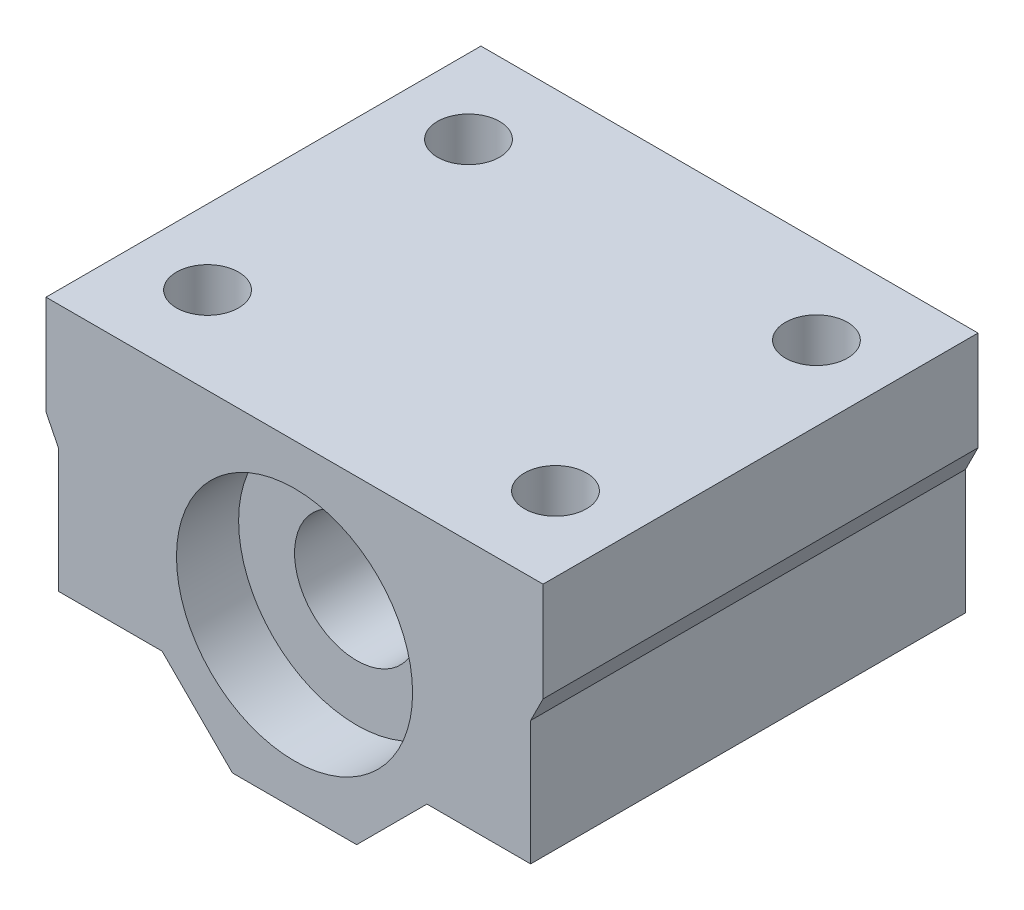
ISO-10303-21;
HEADER;
FILE_DESCRIPTION(('STEP AP214'),'2;1');
FILE_NAME('part.step','',(''),(''),'','','');
FILE_SCHEMA(('AUTOMOTIVE_DESIGN { 1 0 10303 214 1 1 1 1 }'));
ENDSEC;
DATA;
#1=APPLICATION_CONTEXT('core data for automotive mechanical design processes');
#2=APPLICATION_PROTOCOL_DEFINITION('international standard','automotive_design',2000,#1);
#3=PRODUCT_CONTEXT('',#1,'mechanical');
#4=PRODUCT('Part','Part','',(#3));
#5=PRODUCT_RELATED_PRODUCT_CATEGORY('part','',(#4));
#6=PRODUCT_DEFINITION_FORMATION('','',#4);
#7=PRODUCT_DEFINITION_CONTEXT('part definition',#1,'design');
#8=PRODUCT_DEFINITION('design','',#6,#7);
#9=PRODUCT_DEFINITION_SHAPE('','',#8);
#10=(LENGTH_UNIT() NAMED_UNIT(*) SI_UNIT(.MILLI.,.METRE.));
#11=(NAMED_UNIT(*) PLANE_ANGLE_UNIT() SI_UNIT($,.RADIAN.));
#12=(NAMED_UNIT(*) SI_UNIT($,.STERADIAN.) SOLID_ANGLE_UNIT());
#13=UNCERTAINTY_MEASURE_WITH_UNIT(LENGTH_MEASURE(1.E-05),#10,'distance_accuracy_value','');
#14=(GEOMETRIC_REPRESENTATION_CONTEXT(3) GLOBAL_UNCERTAINTY_ASSIGNED_CONTEXT((#13)) GLOBAL_UNIT_ASSIGNED_CONTEXT((#10,
#11,#12)) REPRESENTATION_CONTEXT('',''));
#15=CARTESIAN_POINT('',(0.,0.,0.));
#16=DIRECTION('',(0.,0.,1.));
#17=DIRECTION('',(1.,0.,0.));
#18=AXIS2_PLACEMENT_3D('',#15,#16,#17);
#19=CARTESIAN_POINT('',(0.,0.,0.));
#20=DIRECTION('',(0.,0.,1.));
#21=DIRECTION('',(1.,0.,0.));
#22=AXIS2_PLACEMENT_3D('',#19,#20,#21);
#23=PLANE('',#22);
#24=DIRECTION('',(0.707106781186546,0.707106781186549,0.));
#25=VECTOR('',#24,1.);
#26=CARTESIAN_POINT('',(5.,0.,0.));
#27=LINE('',#26,#25);
#28=CARTESIAN_POINT('',(5.,0.,0.));
#29=VERTEX_POINT('',#28);
#30=CARTESIAN_POINT('',(10.6568542494924,5.65685424949239,0.));
#31=VERTEX_POINT('',#30);
#32=EDGE_CURVE('E166',#29,#31,#27,.T.);
#33=ORIENTED_EDGE('',*,*,#32,.F.);
#34=DIRECTION('',(1.,0.,0.));
#35=VECTOR('',#34,1.);
#36=CARTESIAN_POINT('',(-5.,0.,0.));
#37=LINE('',#36,#35);
#38=CARTESIAN_POINT('',(-5.,0.,0.));
#39=VERTEX_POINT('',#38);
#40=EDGE_CURVE('E105',#39,#29,#37,.T.);
#41=ORIENTED_EDGE('',*,*,#40,.F.);
#42=DIRECTION('',(0.707106781186546,-0.707106781186549,0.));
#43=VECTOR('',#42,1.);
#44=CARTESIAN_POINT('',(-5.,0.,0.));
#45=LINE('',#44,#43);
#46=CARTESIAN_POINT('',(-10.6568542494924,5.65685424949239,0.));
#47=VERTEX_POINT('',#46);
#48=EDGE_CURVE('E99',#47,#39,#45,.T.);
#49=ORIENTED_EDGE('',*,*,#48,.F.);
#50=DIRECTION('',(1.,0.,0.));
#51=VECTOR('',#50,1.);
#52=CARTESIAN_POINT('',(-10.6568542494924,5.65685424949239,0.));
#53=LINE('',#52,#51);
#54=CARTESIAN_POINT('',(-19.,5.65685424949239,0.));
#55=VERTEX_POINT('',#54);
#56=EDGE_CURVE('E153',#55,#47,#53,.T.);
#57=ORIENTED_EDGE('',*,*,#56,.F.);
#58=DIRECTION('',(0.,-1.,0.));
#59=VECTOR('',#58,1.);
#60=CARTESIAN_POINT('',(-19.,5.65685424949239,0.));
#61=LINE('',#60,#59);
#62=CARTESIAN_POINT('',(-19.,15.6568542494924,0.));
#63=VERTEX_POINT('',#62);
#64=EDGE_CURVE('E192',#63,#55,#61,.T.);
#65=ORIENTED_EDGE('',*,*,#64,.F.);
#66=DIRECTION('',(0.447213595499958,-0.894427190999916,0.));
#67=VECTOR('',#66,1.);
#68=CARTESIAN_POINT('',(-19.,15.6568542494924,0.));
#69=LINE('',#68,#67);
#70=CARTESIAN_POINT('',(-20.,17.6568542494924,0.));
#71=VERTEX_POINT('',#70);
#72=EDGE_CURVE('E189',#71,#63,#69,.T.);
#73=ORIENTED_EDGE('',*,*,#72,.F.);
#74=DIRECTION('',(0.,-1.,0.));
#75=VECTOR('',#74,1.);
#76=CARTESIAN_POINT('',(-20.,17.6568542494924,0.));
#77=LINE('',#76,#75);
#78=CARTESIAN_POINT('',(-20.,25.6568542494924,0.));
#79=VERTEX_POINT('',#78);
#80=EDGE_CURVE('E186',#79,#71,#77,.T.);
#81=ORIENTED_EDGE('',*,*,#80,.F.);
#82=DIRECTION('',(-1.,0.,0.));
#83=VECTOR('',#82,1.);
#84=CARTESIAN_POINT('',(20.,25.6568542494924,0.));
#85=LINE('',#84,#83);
#86=CARTESIAN_POINT('',(20.,25.6568542494924,0.));
#87=VERTEX_POINT('',#86);
#88=EDGE_CURVE('E183',#87,#79,#85,.T.);
#89=ORIENTED_EDGE('',*,*,#88,.F.);
#90=DIRECTION('',(0.,1.,0.));
#91=VECTOR('',#90,1.);
#92=CARTESIAN_POINT('',(20.,17.6568542494924,0.));
#93=LINE('',#92,#91);
#94=CARTESIAN_POINT('',(20.,17.6568542494924,0.));
#95=VERTEX_POINT('',#94);
#96=EDGE_CURVE('E180',#95,#87,#93,.T.);
#97=ORIENTED_EDGE('',*,*,#96,.F.);
#98=DIRECTION('',(0.447213595499958,0.894427190999916,0.));
#99=VECTOR('',#98,1.);
#100=CARTESIAN_POINT('',(19.,15.6568542494924,0.));
#101=LINE('',#100,#99);
#102=CARTESIAN_POINT('',(19.,15.6568542494924,0.));
#103=VERTEX_POINT('',#102);
#104=EDGE_CURVE('E177',#103,#95,#101,.T.);
#105=ORIENTED_EDGE('',*,*,#104,.F.);
#106=DIRECTION('',(0.,1.,0.));
#107=VECTOR('',#106,1.);
#108=CARTESIAN_POINT('',(19.,5.65685424949239,0.));
#109=LINE('',#108,#107);
#110=CARTESIAN_POINT('',(19.,5.65685424949239,0.));
#111=VERTEX_POINT('',#110);
#112=EDGE_CURVE('E174',#111,#103,#109,.T.);
#113=ORIENTED_EDGE('',*,*,#112,.F.);
#114=DIRECTION('',(1.,0.,0.));
#115=VECTOR('',#114,1.);
#116=CARTESIAN_POINT('',(10.6568542494924,5.65685424949239,0.));
#117=LINE('',#116,#115);
#118=EDGE_CURVE('E170',#31,#111,#117,.T.);
#119=ORIENTED_EDGE('',*,*,#118,.F.);
#120=EDGE_LOOP('',(#33,#41,#49,#57,#65,#73,#81,#89,#97,#105,#113,#119));
#121=FACE_BOUND('',#120,.T.);
#122=CARTESIAN_POINT('',(0.,12.8284271247462,0.));
#123=DIRECTION('',(0.,0.,1.));
#124=DIRECTION('',(1.,0.,0.));
#125=AXIS2_PLACEMENT_3D('',#122,#123,#124);
#126=CIRCLE('',#125,9.5);
#127=CARTESIAN_POINT('',(9.50000000000001,12.8284271247462,0.));
#128=VERTEX_POINT('',#127);
#129=EDGE_CURVE('E243',#128,#128,#126,.T.);
#130=ORIENTED_EDGE('',*,*,#129,.T.);
#131=EDGE_LOOP('',(#130));
#132=FACE_BOUND('',#131,.T.);
#133=ADVANCED_FACE('F38',(#121,#132),#23,.F.);
#134=CARTESIAN_POINT('',(0.,12.8284271247462,0.));
#135=DIRECTION('',(0.,0.,1.));
#136=DIRECTION('',(1.,0.,0.));
#137=AXIS2_PLACEMENT_3D('',#134,#135,#136);
#138=CYLINDRICAL_SURFACE('',#137,5.);
#139=CARTESIAN_POINT('',(0.,12.8284271247462,30.));
#140=DIRECTION('',(0.,0.,1.));
#141=DIRECTION('',(1.,0.,0.));
#142=AXIS2_PLACEMENT_3D('',#139,#140,#141);
#143=CIRCLE('',#142,5.);
#144=CARTESIAN_POINT('',(5.00000000000001,12.8284271247462,30.));
#145=VERTEX_POINT('',#144);
#146=EDGE_CURVE('E238',#145,#145,#143,.T.);
#147=ORIENTED_EDGE('',*,*,#146,.T.);
#148=EDGE_LOOP('',(#147));
#149=FACE_BOUND('',#148,.T.);
#150=CARTESIAN_POINT('',(0.,12.8284271247462,4.99999999999999));
#151=DIRECTION('',(0.,0.,-1.));
#152=DIRECTION('',(-1.,0.,0.));
#153=AXIS2_PLACEMENT_3D('',#150,#151,#152);
#154=CIRCLE('',#153,5.);
#155=CARTESIAN_POINT('',(-5.,12.8284271247462,4.99999999999999));
#156=VERTEX_POINT('',#155);
#157=EDGE_CURVE('E235',#156,#156,#154,.F.);
#158=ORIENTED_EDGE('',*,*,#157,.F.);
#159=EDGE_LOOP('',(#158));
#160=FACE_BOUND('',#159,.T.);
#161=ADVANCED_FACE('F327',(#149,#160),#138,.F.);
#162=CARTESIAN_POINT('',(5.,0.,35.));
#163=DIRECTION('',(-0.707106781186549,0.707106781186546,0.));
#164=DIRECTION('',(-0.707106781186546,-0.707106781186549,0.));
#165=AXIS2_PLACEMENT_3D('',#162,#163,#164);
#166=PLANE('',#165);
#167=ORIENTED_EDGE('',*,*,#32,.T.);
#168=DIRECTION('',(0.,0.,-1.));
#169=VECTOR('',#168,1.);
#170=CARTESIAN_POINT('',(10.6568542494924,5.65685424949239,35.));
#171=LINE('',#170,#169);
#172=CARTESIAN_POINT('',(10.6568542494924,5.65685424949239,35.));
#173=VERTEX_POINT('',#172);
#174=EDGE_CURVE('E11',#173,#31,#171,.T.);
#175=ORIENTED_EDGE('',*,*,#174,.F.);
#176=DIRECTION('',(0.707106781186546,0.707106781186549,0.));
#177=VECTOR('',#176,1.);
#178=CARTESIAN_POINT('',(5.,0.,35.));
#179=LINE('',#178,#177);
#180=CARTESIAN_POINT('',(5.,0.,35.));
#181=VERTEX_POINT('',#180);
#182=EDGE_CURVE('E201',#181,#173,#179,.T.);
#183=ORIENTED_EDGE('',*,*,#182,.F.);
#184=DIRECTION('',(0.,0.,-1.));
#185=VECTOR('',#184,1.);
#186=CARTESIAN_POINT('',(5.,0.,35.));
#187=LINE('',#186,#185);
#188=EDGE_CURVE('E162',#181,#29,#187,.T.);
#189=ORIENTED_EDGE('',*,*,#188,.T.);
#190=EDGE_LOOP('',(#167,#175,#183,#189));
#191=FACE_BOUND('',#190,.T.);
#192=ADVANCED_FACE('F40',(#191),#166,.F.);
#193=CARTESIAN_POINT('',(10.6568542494924,5.65685424949239,35.));
#194=DIRECTION('',(0.,1.,0.));
#195=DIRECTION('',(-1.,0.,0.));
#196=AXIS2_PLACEMENT_3D('',#193,#194,#195);
#197=PLANE('',#196);
#198=CARTESIAN_POINT('',(14.,5.65685424949239,28.));
#199=DIRECTION('',(0.,1.,0.));
#200=DIRECTION('',(-1.,0.,0.));
#201=AXIS2_PLACEMENT_3D('',#198,#199,#200);
#202=CIRCLE('',#201,2.49999999999999);
#203=CARTESIAN_POINT('',(11.5,5.65685424949239,28.));
#204=VERTEX_POINT('',#203);
#205=EDGE_CURVE('E377',#204,#204,#202,.T.);
#206=ORIENTED_EDGE('',*,*,#205,.T.);
#207=EDGE_LOOP('',(#206));
#208=FACE_BOUND('',#207,.T.);
#209=CARTESIAN_POINT('',(14.,5.65685424949239,6.99999999999999));
#210=DIRECTION('',(0.,1.,0.));
#211=DIRECTION('',(-1.,0.,0.));
#212=AXIS2_PLACEMENT_3D('',#209,#210,#211);
#213=CIRCLE('',#212,2.49999999999999);
#214=CARTESIAN_POINT('',(11.5,5.65685424949239,6.99999999999999));
#215=VERTEX_POINT('',#214);
#216=EDGE_CURVE('E252',#215,#215,#213,.T.);
#217=ORIENTED_EDGE('',*,*,#216,.T.);
#218=EDGE_LOOP('',(#217));
#219=FACE_BOUND('',#218,.T.);
#220=ORIENTED_EDGE('',*,*,#118,.T.);
#221=DIRECTION('',(0.,0.,-1.));
#222=VECTOR('',#221,1.);
#223=CARTESIAN_POINT('',(19.,5.65685424949239,35.));
#224=LINE('',#223,#222);
#225=CARTESIAN_POINT('',(19.,5.65685424949239,35.));
#226=VERTEX_POINT('',#225);
#227=EDGE_CURVE('E49',#226,#111,#224,.T.);
#228=ORIENTED_EDGE('',*,*,#227,.F.);
#229=DIRECTION('',(1.,0.,0.));
#230=VECTOR('',#229,1.);
#231=CARTESIAN_POINT('',(10.6568542494924,5.65685424949239,35.));
#232=LINE('',#231,#230);
#233=EDGE_CURVE('E113',#173,#226,#232,.T.);
#234=ORIENTED_EDGE('',*,*,#233,.F.);
#235=ORIENTED_EDGE('',*,*,#174,.T.);
#236=EDGE_LOOP('',(#220,#228,#234,#235));
#237=FACE_BOUND('',#236,.T.);
#238=ADVANCED_FACE('F420',(#208,#219,#237),#197,.F.);
#239=CARTESIAN_POINT('',(19.,5.65685424949239,35.));
#240=DIRECTION('',(-1.,0.,0.));
#241=DIRECTION('',(0.,0.,1.));
#242=AXIS2_PLACEMENT_3D('',#239,#240,#241);
#243=PLANE('',#242);
#244=ORIENTED_EDGE('',*,*,#112,.T.);
#245=DIRECTION('',(0.,0.,-1.));
#246=VECTOR('',#245,1.);
#247=CARTESIAN_POINT('',(19.,15.6568542494924,35.));
#248=LINE('',#247,#246);
#249=CARTESIAN_POINT('',(19.,15.6568542494924,35.));
#250=VERTEX_POINT('',#249);
#251=EDGE_CURVE('E228',#250,#103,#248,.T.);
#252=ORIENTED_EDGE('',*,*,#251,.F.);
#253=DIRECTION('',(0.,1.,0.));
#254=VECTOR('',#253,1.);
#255=CARTESIAN_POINT('',(19.,5.65685424949239,35.));
#256=LINE('',#255,#254);
#257=EDGE_CURVE('E279',#226,#250,#256,.T.);
#258=ORIENTED_EDGE('',*,*,#257,.F.);
#259=ORIENTED_EDGE('',*,*,#227,.T.);
#260=EDGE_LOOP('',(#244,#252,#258,#259));
#261=FACE_BOUND('',#260,.T.);
#262=ADVANCED_FACE('F417',(#261),#243,.F.);
#263=CARTESIAN_POINT('',(19.,15.6568542494924,35.));
#264=DIRECTION('',(-0.894427190999916,0.447213595499958,0.));
#265=DIRECTION('',(-0.447213595499958,-0.894427190999916,0.));
#266=AXIS2_PLACEMENT_3D('',#263,#264,#265);
#267=PLANE('',#266);
#268=ORIENTED_EDGE('',*,*,#104,.T.);
#269=DIRECTION('',(0.,0.,-1.));
#270=VECTOR('',#269,1.);
#271=CARTESIAN_POINT('',(20.,17.6568542494924,35.));
#272=LINE('',#271,#270);
#273=CARTESIAN_POINT('',(20.,17.6568542494924,35.));
#274=VERTEX_POINT('',#273);
#275=EDGE_CURVE('E224',#274,#95,#272,.T.);
#276=ORIENTED_EDGE('',*,*,#275,.F.);
#277=DIRECTION('',(0.447213595499958,0.894427190999916,0.));
#278=VECTOR('',#277,1.);
#279=CARTESIAN_POINT('',(19.,15.6568542494924,35.));
#280=LINE('',#279,#278);
#281=EDGE_CURVE('E282',#250,#274,#280,.T.);
#282=ORIENTED_EDGE('',*,*,#281,.F.);
#283=ORIENTED_EDGE('',*,*,#251,.T.);
#284=EDGE_LOOP('',(#268,#276,#282,#283));
#285=FACE_BOUND('',#284,.T.);
#286=ADVANCED_FACE('F413',(#285),#267,.F.);
#287=CARTESIAN_POINT('',(20.,17.6568542494924,35.));
#288=DIRECTION('',(-1.,0.,0.));
#289=DIRECTION('',(0.,-1.,0.));
#290=AXIS2_PLACEMENT_3D('',#287,#288,#289);
#291=PLANE('',#290);
#292=ORIENTED_EDGE('',*,*,#96,.T.);
#293=DIRECTION('',(0.,0.,-1.));
#294=VECTOR('',#293,1.);
#295=CARTESIAN_POINT('',(20.,25.6568542494924,35.));
#296=LINE('',#295,#294);
#297=CARTESIAN_POINT('',(20.,25.6568542494924,35.));
#298=VERTEX_POINT('',#297);
#299=EDGE_CURVE('E220',#298,#87,#296,.T.);
#300=ORIENTED_EDGE('',*,*,#299,.F.);
#301=DIRECTION('',(0.,1.,0.));
#302=VECTOR('',#301,1.);
#303=CARTESIAN_POINT('',(20.,17.6568542494924,35.));
#304=LINE('',#303,#302);
#305=EDGE_CURVE('E285',#274,#298,#304,.T.);
#306=ORIENTED_EDGE('',*,*,#305,.F.);
#307=ORIENTED_EDGE('',*,*,#275,.T.);
#308=EDGE_LOOP('',(#292,#300,#306,#307));
#309=FACE_BOUND('',#308,.T.);
#310=ADVANCED_FACE('F392',(#309),#291,.F.);
#311=CARTESIAN_POINT('',(20.,25.6568542494924,35.));
#312=DIRECTION('',(0.,-1.,0.));
#313=DIRECTION('',(1.,0.,0.));
#314=AXIS2_PLACEMENT_3D('',#311,#312,#313);
#315=PLANE('',#314);
#316=CARTESIAN_POINT('',(-14.,25.6568542494924,28.));
#317=DIRECTION('',(0.,1.,0.));
#318=DIRECTION('',(1.,0.,0.));
#319=AXIS2_PLACEMENT_3D('',#316,#317,#318);
#320=CIRCLE('',#319,2.5);
#321=CARTESIAN_POINT('',(-11.5,25.6568542494924,28.));
#322=VERTEX_POINT('',#321);
#323=EDGE_CURVE('E368',#322,#322,#320,.T.);
#324=ORIENTED_EDGE('',*,*,#323,.F.);
#325=EDGE_LOOP('',(#324));
#326=FACE_BOUND('',#325,.T.);
#327=CARTESIAN_POINT('',(14.,25.6568542494924,28.));
#328=DIRECTION('',(0.,1.,0.));
#329=DIRECTION('',(1.,0.,0.));
#330=AXIS2_PLACEMENT_3D('',#327,#328,#329);
#331=CIRCLE('',#330,2.49999999999999);
#332=CARTESIAN_POINT('',(16.5,25.6568542494924,28.));
#333=VERTEX_POINT('',#332);
#334=EDGE_CURVE('E373',#333,#333,#331,.T.);
#335=ORIENTED_EDGE('',*,*,#334,.F.);
#336=EDGE_LOOP('',(#335));
#337=FACE_BOUND('',#336,.T.);
#338=CARTESIAN_POINT('',(14.,25.6568542494924,6.99999999999999));
#339=DIRECTION('',(0.,1.,0.));
#340=DIRECTION('',(-1.,0.,0.));
#341=AXIS2_PLACEMENT_3D('',#338,#339,#340);
#342=CIRCLE('',#341,2.49999999999999);
#343=CARTESIAN_POINT('',(11.5,25.6568542494924,6.99999999999999));
#344=VERTEX_POINT('',#343);
#345=EDGE_CURVE('E258',#344,#344,#342,.T.);
#346=ORIENTED_EDGE('',*,*,#345,.F.);
#347=EDGE_LOOP('',(#346));
#348=FACE_BOUND('',#347,.T.);
#349=CARTESIAN_POINT('',(-14.,25.6568542494924,7.));
#350=DIRECTION('',(0.,1.,0.));
#351=DIRECTION('',(-1.,0.,0.));
#352=AXIS2_PLACEMENT_3D('',#349,#350,#351);
#353=CIRCLE('',#352,2.5);
#354=CARTESIAN_POINT('',(-16.5,25.6568542494924,7.));
#355=VERTEX_POINT('',#354);
#356=EDGE_CURVE('E244',#355,#355,#353,.T.);
#357=ORIENTED_EDGE('',*,*,#356,.F.);
#358=EDGE_LOOP('',(#357));
#359=FACE_BOUND('',#358,.T.);
#360=ORIENTED_EDGE('',*,*,#88,.T.);
#361=DIRECTION('',(0.,0.,-1.));
#362=VECTOR('',#361,1.);
#363=CARTESIAN_POINT('',(-20.,25.6568542494924,35.));
#364=LINE('',#363,#362);
#365=CARTESIAN_POINT('',(-20.,25.6568542494924,35.));
#366=VERTEX_POINT('',#365);
#367=EDGE_CURVE('E216',#366,#79,#364,.T.);
#368=ORIENTED_EDGE('',*,*,#367,.F.);
#369=DIRECTION('',(-1.,0.,0.));
#370=VECTOR('',#369,1.);
#371=CARTESIAN_POINT('',(20.,25.6568542494924,35.));
#372=LINE('',#371,#370);
#373=EDGE_CURVE('E288',#298,#366,#372,.T.);
#374=ORIENTED_EDGE('',*,*,#373,.F.);
#375=ORIENTED_EDGE('',*,*,#299,.T.);
#376=EDGE_LOOP('',(#360,#368,#374,#375));
#377=FACE_BOUND('',#376,.T.);
#378=ADVANCED_FACE('F388',(#326,#337,#348,#359,#377),#315,.F.);
#379=CARTESIAN_POINT('',(-20.,17.6568542494924,35.));
#380=DIRECTION('',(1.,0.,0.));
#381=DIRECTION('',(0.,1.,0.));
#382=AXIS2_PLACEMENT_3D('',#379,#380,#381);
#383=PLANE('',#382);
#384=ORIENTED_EDGE('',*,*,#80,.T.);
#385=DIRECTION('',(0.,0.,-1.));
#386=VECTOR('',#385,1.);
#387=CARTESIAN_POINT('',(-20.,17.6568542494924,35.));
#388=LINE('',#387,#386);
#389=CARTESIAN_POINT('',(-20.,17.6568542494924,35.));
#390=VERTEX_POINT('',#389);
#391=EDGE_CURVE('E212',#390,#71,#388,.T.);
#392=ORIENTED_EDGE('',*,*,#391,.F.);
#393=DIRECTION('',(0.,-1.,0.));
#394=VECTOR('',#393,1.);
#395=CARTESIAN_POINT('',(-20.,17.6568542494924,35.));
#396=LINE('',#395,#394);
#397=EDGE_CURVE('E291',#366,#390,#396,.T.);
#398=ORIENTED_EDGE('',*,*,#397,.F.);
#399=ORIENTED_EDGE('',*,*,#367,.T.);
#400=EDGE_LOOP('',(#384,#392,#398,#399));
#401=FACE_BOUND('',#400,.T.);
#402=ADVANCED_FACE('F391',(#401),#383,.F.);
#403=CARTESIAN_POINT('',(-19.,15.6568542494924,35.));
#404=DIRECTION('',(0.894427190999916,0.447213595499958,0.));
#405=DIRECTION('',(-0.447213595499958,0.894427190999916,0.));
#406=AXIS2_PLACEMENT_3D('',#403,#404,#405);
#407=PLANE('',#406);
#408=ORIENTED_EDGE('',*,*,#72,.T.);
#409=DIRECTION('',(0.,0.,-1.));
#410=VECTOR('',#409,1.);
#411=CARTESIAN_POINT('',(-19.,15.6568542494924,35.));
#412=LINE('',#411,#410);
#413=CARTESIAN_POINT('',(-19.,15.6568542494924,35.));
#414=VERTEX_POINT('',#413);
#415=EDGE_CURVE('E208',#414,#63,#412,.T.);
#416=ORIENTED_EDGE('',*,*,#415,.F.);
#417=DIRECTION('',(0.447213595499958,-0.894427190999916,0.));
#418=VECTOR('',#417,1.);
#419=CARTESIAN_POINT('',(-19.,15.6568542494924,35.));
#420=LINE('',#419,#418);
#421=EDGE_CURVE('E294',#390,#414,#420,.T.);
#422=ORIENTED_EDGE('',*,*,#421,.F.);
#423=ORIENTED_EDGE('',*,*,#391,.T.);
#424=EDGE_LOOP('',(#408,#416,#422,#423));
#425=FACE_BOUND('',#424,.T.);
#426=ADVANCED_FACE('F302',(#425),#407,.F.);
#427=CARTESIAN_POINT('',(-19.,5.65685424949239,35.));
#428=DIRECTION('',(1.,0.,0.));
#429=DIRECTION('',(0.,1.,0.));
#430=AXIS2_PLACEMENT_3D('',#427,#428,#429);
#431=PLANE('',#430);
#432=ORIENTED_EDGE('',*,*,#64,.T.);
#433=DIRECTION('',(0.,0.,-1.));
#434=VECTOR('',#433,1.);
#435=CARTESIAN_POINT('',(-19.,5.65685424949239,35.));
#436=LINE('',#435,#434);
#437=CARTESIAN_POINT('',(-19.,5.65685424949239,35.));
#438=VERTEX_POINT('',#437);
#439=EDGE_CURVE('E155',#438,#55,#436,.T.);
#440=ORIENTED_EDGE('',*,*,#439,.F.);
#441=DIRECTION('',(0.,-1.,0.));
#442=VECTOR('',#441,1.);
#443=CARTESIAN_POINT('',(-19.,5.65685424949239,35.));
#444=LINE('',#443,#442);
#445=EDGE_CURVE('E144',#414,#438,#444,.T.);
#446=ORIENTED_EDGE('',*,*,#445,.F.);
#447=ORIENTED_EDGE('',*,*,#415,.T.);
#448=EDGE_LOOP('',(#432,#440,#446,#447));
#449=FACE_BOUND('',#448,.T.);
#450=ADVANCED_FACE('F306',(#449),#431,.F.);
#451=CARTESIAN_POINT('',(-10.6568542494924,5.65685424949239,35.));
#452=DIRECTION('',(0.,1.,0.));
#453=DIRECTION('',(-1.,0.,0.));
#454=AXIS2_PLACEMENT_3D('',#451,#452,#453);
#455=PLANE('',#454);
#456=CARTESIAN_POINT('',(-14.,5.65685424949239,28.));
#457=DIRECTION('',(0.,1.,0.));
#458=DIRECTION('',(-1.,0.,0.));
#459=AXIS2_PLACEMENT_3D('',#456,#457,#458);
#460=CIRCLE('',#459,2.5);
#461=CARTESIAN_POINT('',(-16.5,5.65685424949239,28.));
#462=VERTEX_POINT('',#461);
#463=EDGE_CURVE('E42',#462,#462,#460,.T.);
#464=ORIENTED_EDGE('',*,*,#463,.T.);
#465=EDGE_LOOP('',(#464));
#466=FACE_BOUND('',#465,.T.);
#467=CARTESIAN_POINT('',(-14.,5.65685424949239,7.));
#468=DIRECTION('',(0.,1.,0.));
#469=DIRECTION('',(-1.,0.,0.));
#470=AXIS2_PLACEMENT_3D('',#467,#468,#469);
#471=CIRCLE('',#470,2.5);
#472=CARTESIAN_POINT('',(-16.5,5.65685424949239,7.));
#473=VERTEX_POINT('',#472);
#474=EDGE_CURVE('E240',#473,#473,#471,.T.);
#475=ORIENTED_EDGE('',*,*,#474,.T.);
#476=EDGE_LOOP('',(#475));
#477=FACE_BOUND('',#476,.T.);
#478=ORIENTED_EDGE('',*,*,#56,.T.);
#479=DIRECTION('',(0.,0.,-1.));
#480=VECTOR('',#479,1.);
#481=CARTESIAN_POINT('',(-10.6568542494924,5.65685424949239,35.));
#482=LINE('',#481,#480);
#483=CARTESIAN_POINT('',(-10.6568542494924,5.65685424949239,35.));
#484=VERTEX_POINT('',#483);
#485=EDGE_CURVE('E150',#484,#47,#482,.T.);
#486=ORIENTED_EDGE('',*,*,#485,.F.);
#487=DIRECTION('',(1.,0.,0.));
#488=VECTOR('',#487,1.);
#489=CARTESIAN_POINT('',(-10.6568542494924,5.65685424949239,35.));
#490=LINE('',#489,#488);
#491=EDGE_CURVE('E138',#438,#484,#490,.T.);
#492=ORIENTED_EDGE('',*,*,#491,.F.);
#493=ORIENTED_EDGE('',*,*,#439,.T.);
#494=EDGE_LOOP('',(#478,#486,#492,#493));
#495=FACE_BOUND('',#494,.T.);
#496=ADVANCED_FACE('F151',(#466,#477,#495),#455,.F.);
#497=CARTESIAN_POINT('',(-5.,0.,35.));
#498=DIRECTION('',(0.707106781186549,0.707106781186546,0.));
#499=DIRECTION('',(-0.707106781186546,0.707106781186549,0.));
#500=AXIS2_PLACEMENT_3D('',#497,#498,#499);
#501=PLANE('',#500);
#502=ORIENTED_EDGE('',*,*,#48,.T.);
#503=DIRECTION('',(0.,0.,-1.));
#504=VECTOR('',#503,1.);
#505=CARTESIAN_POINT('',(-5.,0.,35.));
#506=LINE('',#505,#504);
#507=CARTESIAN_POINT('',(-5.,0.,35.));
#508=VERTEX_POINT('',#507);
#509=EDGE_CURVE('E156',#508,#39,#506,.T.);
#510=ORIENTED_EDGE('',*,*,#509,.F.);
#511=DIRECTION('',(0.707106781186546,-0.707106781186549,0.));
#512=VECTOR('',#511,1.);
#513=CARTESIAN_POINT('',(-5.,0.,35.));
#514=LINE('',#513,#512);
#515=EDGE_CURVE('E142',#484,#508,#514,.T.);
#516=ORIENTED_EDGE('',*,*,#515,.F.);
#517=ORIENTED_EDGE('',*,*,#485,.T.);
#518=EDGE_LOOP('',(#502,#510,#516,#517));
#519=FACE_BOUND('',#518,.T.);
#520=ADVANCED_FACE('F158',(#519),#501,.F.);
#521=CARTESIAN_POINT('',(-5.,0.,35.));
#522=DIRECTION('',(0.,1.,0.));
#523=DIRECTION('',(-1.,0.,0.));
#524=AXIS2_PLACEMENT_3D('',#521,#522,#523);
#525=PLANE('',#524);
#526=ORIENTED_EDGE('',*,*,#40,.T.);
#527=ORIENTED_EDGE('',*,*,#188,.F.);
#528=DIRECTION('',(1.,0.,0.));
#529=VECTOR('',#528,1.);
#530=CARTESIAN_POINT('',(-5.,0.,35.));
#531=LINE('',#530,#529);
#532=EDGE_CURVE('E58',#508,#181,#531,.T.);
#533=ORIENTED_EDGE('',*,*,#532,.F.);
#534=ORIENTED_EDGE('',*,*,#509,.T.);
#535=EDGE_LOOP('',(#526,#527,#533,#534));
#536=FACE_BOUND('',#535,.T.);
#537=ADVANCED_FACE('F314',(#536),#525,.F.);
#538=CARTESIAN_POINT('',(0.,0.,35.));
#539=DIRECTION('',(0.,0.,1.));
#540=DIRECTION('',(1.,0.,0.));
#541=AXIS2_PLACEMENT_3D('',#538,#539,#540);
#542=PLANE('',#541);
#543=CARTESIAN_POINT('',(0.,12.8284271247462,35.));
#544=DIRECTION('',(0.,0.,1.));
#545=DIRECTION('',(1.,0.,0.));
#546=AXIS2_PLACEMENT_3D('',#543,#544,#545);
#547=CIRCLE('',#546,9.5);
#548=CARTESIAN_POINT('',(9.50000000000001,12.8284271247462,35.));
#549=VERTEX_POINT('',#548);
#550=EDGE_CURVE('E268',#549,#549,#547,.T.);
#551=ORIENTED_EDGE('',*,*,#550,.F.);
#552=EDGE_LOOP('',(#551));
#553=FACE_BOUND('',#552,.T.);
#554=ORIENTED_EDGE('',*,*,#182,.T.);
#555=ORIENTED_EDGE('',*,*,#233,.T.);
#556=ORIENTED_EDGE('',*,*,#257,.T.);
#557=ORIENTED_EDGE('',*,*,#281,.T.);
#558=ORIENTED_EDGE('',*,*,#305,.T.);
#559=ORIENTED_EDGE('',*,*,#373,.T.);
#560=ORIENTED_EDGE('',*,*,#397,.T.);
#561=ORIENTED_EDGE('',*,*,#421,.T.);
#562=ORIENTED_EDGE('',*,*,#445,.T.);
#563=ORIENTED_EDGE('',*,*,#491,.T.);
#564=ORIENTED_EDGE('',*,*,#515,.T.);
#565=ORIENTED_EDGE('',*,*,#532,.T.);
#566=EDGE_LOOP('',(#554,#555,#556,#557,#558,#559,#560,#561,#562,#563,#564,#565));
#567=FACE_BOUND('',#566,.T.);
#568=ADVANCED_FACE('F140',(#553,#567),#542,.T.);
#569=CARTESIAN_POINT('',(0.,12.8284271247462,30.));
#570=DIRECTION('',(0.,0.,1.));
#571=DIRECTION('',(1.,0.,0.));
#572=AXIS2_PLACEMENT_3D('',#569,#570,#571);
#573=CYLINDRICAL_SURFACE('',#572,9.5);
#574=CARTESIAN_POINT('',(0.,12.8284271247462,30.));
#575=DIRECTION('',(0.,0.,1.));
#576=DIRECTION('',(1.,0.,0.));
#577=AXIS2_PLACEMENT_3D('',#574,#575,#576);
#578=CIRCLE('',#577,9.5);
#579=CARTESIAN_POINT('',(9.50000000000001,12.8284271247462,30.));
#580=VERTEX_POINT('',#579);
#581=EDGE_CURVE('E171',#580,#580,#578,.T.);
#582=ORIENTED_EDGE('',*,*,#581,.F.);
#583=EDGE_LOOP('',(#582));
#584=FACE_BOUND('',#583,.T.);
#585=ORIENTED_EDGE('',*,*,#550,.T.);
#586=EDGE_LOOP('',(#585));
#587=FACE_BOUND('',#586,.T.);
#588=ADVANCED_FACE('F321',(#584,#587),#573,.F.);
#589=CARTESIAN_POINT('',(0.,12.8284271247462,30.));
#590=DIRECTION('',(0.,0.,1.));
#591=DIRECTION('',(1.,0.,0.));
#592=AXIS2_PLACEMENT_3D('',#589,#590,#591);
#593=PLANE('',#592);
#594=ORIENTED_EDGE('',*,*,#146,.F.);
#595=EDGE_LOOP('',(#594));
#596=FACE_BOUND('',#595,.T.);
#597=ORIENTED_EDGE('',*,*,#581,.T.);
#598=EDGE_LOOP('',(#597));
#599=FACE_BOUND('',#598,.T.);
#600=ADVANCED_FACE('F336',(#596,#599),#593,.T.);
#601=CARTESIAN_POINT('',(0.,12.8284271247462,4.99999999999999));
#602=DIRECTION('',(0.,0.,-1.));
#603=DIRECTION('',(1.,0.,0.));
#604=AXIS2_PLACEMENT_3D('',#601,#602,#603);
#605=PLANE('',#604);
#606=CARTESIAN_POINT('',(0.,12.8284271247462,4.99999999999999));
#607=DIRECTION('',(0.,0.,1.));
#608=DIRECTION('',(1.,0.,0.));
#609=AXIS2_PLACEMENT_3D('',#606,#607,#608);
#610=CIRCLE('',#609,9.5);
#611=CARTESIAN_POINT('',(9.50000000000001,12.8284271247462,4.99999999999999));
#612=VERTEX_POINT('',#611);
#613=EDGE_CURVE('E239',#612,#612,#610,.T.);
#614=ORIENTED_EDGE('',*,*,#613,.F.);
#615=EDGE_LOOP('',(#614));
#616=FACE_BOUND('',#615,.T.);
#617=ORIENTED_EDGE('',*,*,#157,.T.);
#618=EDGE_LOOP('',(#617));
#619=FACE_BOUND('',#618,.T.);
#620=ADVANCED_FACE('F339',(#616,#619),#605,.T.);
#621=CARTESIAN_POINT('',(0.,12.8284271247462,4.99999999999999));
#622=DIRECTION('',(0.,0.,-1.));
#623=DIRECTION('',(-1.,0.,0.));
#624=AXIS2_PLACEMENT_3D('',#621,#622,#623);
#625=CYLINDRICAL_SURFACE('',#624,9.5);
#626=ORIENTED_EDGE('',*,*,#613,.T.);
#627=EDGE_LOOP('',(#626));
#628=FACE_BOUND('',#627,.T.);
#629=ORIENTED_EDGE('',*,*,#129,.F.);
#630=EDGE_LOOP('',(#629));
#631=FACE_BOUND('',#630,.T.);
#632=ADVANCED_FACE('F342',(#628,#631),#625,.F.);
#633=CARTESIAN_POINT('',(-14.,0.,7.));
#634=DIRECTION('',(0.,1.,0.));
#635=DIRECTION('',(-1.,0.,0.));
#636=AXIS2_PLACEMENT_3D('',#633,#634,#635);
#637=CYLINDRICAL_SURFACE('',#636,2.5);
#638=ORIENTED_EDGE('',*,*,#356,.T.);
#639=EDGE_LOOP('',(#638));
#640=FACE_BOUND('',#639,.T.);
#641=ORIENTED_EDGE('',*,*,#474,.F.);
#642=EDGE_LOOP('',(#641));
#643=FACE_BOUND('',#642,.T.);
#644=ADVANCED_FACE('F345',(#640,#643),#637,.F.);
#645=CARTESIAN_POINT('',(14.,0.,6.99999999999999));
#646=DIRECTION('',(0.,1.,0.));
#647=DIRECTION('',(-1.,0.,0.));
#648=AXIS2_PLACEMENT_3D('',#645,#646,#647);
#649=CYLINDRICAL_SURFACE('',#648,2.49999999999999);
#650=ORIENTED_EDGE('',*,*,#345,.T.);
#651=EDGE_LOOP('',(#650));
#652=FACE_BOUND('',#651,.T.);
#653=ORIENTED_EDGE('',*,*,#216,.F.);
#654=EDGE_LOOP('',(#653));
#655=FACE_BOUND('',#654,.T.);
#656=ADVANCED_FACE('F352',(#652,#655),#649,.F.);
#657=CARTESIAN_POINT('',(14.,0.,28.));
#658=DIRECTION('',(0.,1.,0.));
#659=DIRECTION('',(-1.,0.,0.));
#660=AXIS2_PLACEMENT_3D('',#657,#658,#659);
#661=CYLINDRICAL_SURFACE('',#660,2.49999999999999);
#662=ORIENTED_EDGE('',*,*,#334,.T.);
#663=EDGE_LOOP('',(#662));
#664=FACE_BOUND('',#663,.T.);
#665=ORIENTED_EDGE('',*,*,#205,.F.);
#666=EDGE_LOOP('',(#665));
#667=FACE_BOUND('',#666,.T.);
#668=ADVANCED_FACE('F355',(#664,#667),#661,.F.);
#669=CARTESIAN_POINT('',(-14.,0.,28.));
#670=DIRECTION('',(0.,1.,0.));
#671=DIRECTION('',(-1.,0.,0.));
#672=AXIS2_PLACEMENT_3D('',#669,#670,#671);
#673=CYLINDRICAL_SURFACE('',#672,2.5);
#674=ORIENTED_EDGE('',*,*,#323,.T.);
#675=EDGE_LOOP('',(#674));
#676=FACE_BOUND('',#675,.T.);
#677=ORIENTED_EDGE('',*,*,#463,.F.);
#678=EDGE_LOOP('',(#677));
#679=FACE_BOUND('',#678,.T.);
#680=ADVANCED_FACE('F359',(#676,#679),#673,.F.);
#681=CLOSED_SHELL('',(#133,#161,#192,#238,#262,#286,#310,#378,#402,#426,#450,#496,#520,#537,
#568,#588,#600,#620,#632,#644,#656,#668,#680));
#682=MANIFOLD_SOLID_BREP('B2',#681);
#683=ADVANCED_BREP_SHAPE_REPRESENTATION('',(#18,#682),#14);
#684=SHAPE_DEFINITION_REPRESENTATION(#9,#683);
ENDSEC;
END-ISO-10303-21;
